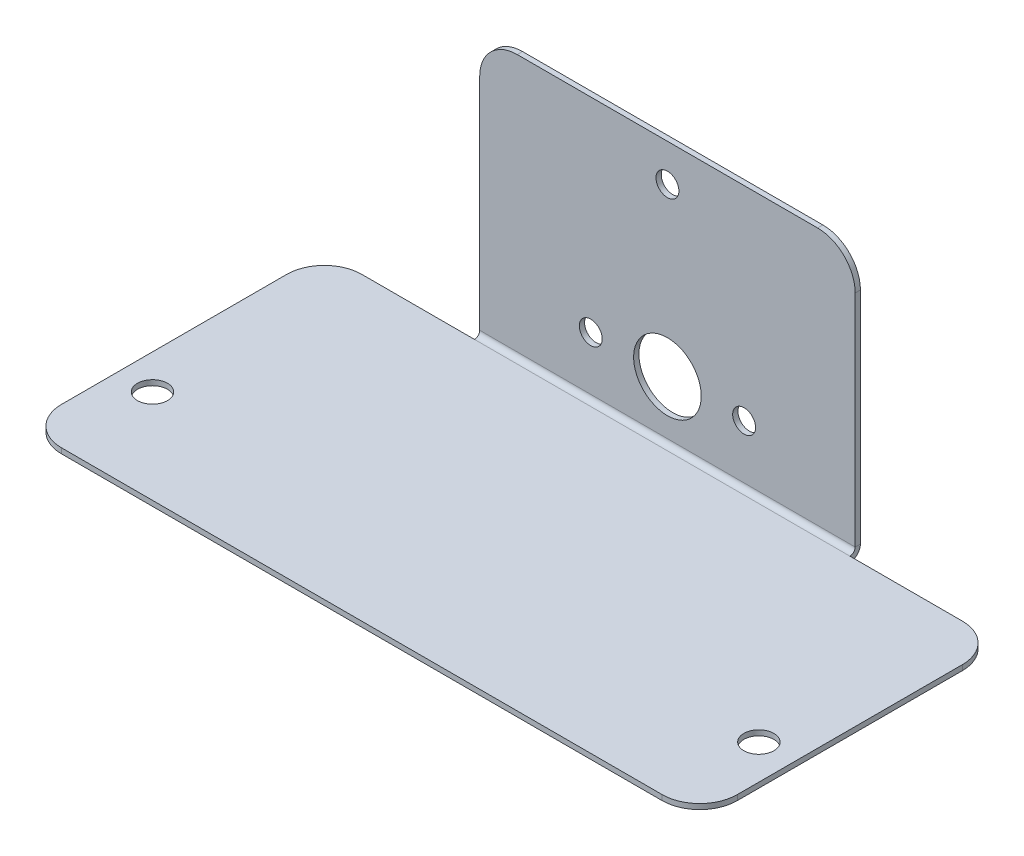
ISO-10303-21;
HEADER;
FILE_DESCRIPTION(('STEP AP214'),'2;1');
FILE_NAME('part.step','',(''),(''),'','','');
FILE_SCHEMA(('AUTOMOTIVE_DESIGN { 1 0 10303 214 1 1 1 1 }'));
ENDSEC;
DATA;
#1=APPLICATION_CONTEXT('core data for automotive mechanical design processes');
#2=APPLICATION_PROTOCOL_DEFINITION('international standard','automotive_design',2000,#1);
#3=PRODUCT_CONTEXT('',#1,'mechanical');
#4=PRODUCT('Part','Part','',(#3));
#5=PRODUCT_RELATED_PRODUCT_CATEGORY('part','',(#4));
#6=PRODUCT_DEFINITION_FORMATION('','',#4);
#7=PRODUCT_DEFINITION_CONTEXT('part definition',#1,'design');
#8=PRODUCT_DEFINITION('design','',#6,#7);
#9=PRODUCT_DEFINITION_SHAPE('','',#8);
#10=(LENGTH_UNIT() NAMED_UNIT(*) SI_UNIT(.MILLI.,.METRE.));
#11=(NAMED_UNIT(*) PLANE_ANGLE_UNIT() SI_UNIT($,.RADIAN.));
#12=(NAMED_UNIT(*) SI_UNIT($,.STERADIAN.) SOLID_ANGLE_UNIT());
#13=UNCERTAINTY_MEASURE_WITH_UNIT(LENGTH_MEASURE(1.E-05),#10,'distance_accuracy_value','');
#14=(GEOMETRIC_REPRESENTATION_CONTEXT(3) GLOBAL_UNCERTAINTY_ASSIGNED_CONTEXT((#13)) GLOBAL_UNIT_ASSIGNED_CONTEXT((#10,
#11,#12)) REPRESENTATION_CONTEXT('',''));
#15=CARTESIAN_POINT('',(0.,0.,0.));
#16=DIRECTION('',(0.,0.,1.));
#17=DIRECTION('',(1.,0.,0.));
#18=AXIS2_PLACEMENT_3D('',#15,#16,#17);
#19=CARTESIAN_POINT('',(-45.,-0.7,-20.));
#20=DIRECTION('',(0.,0.,-1.));
#21=DIRECTION('',(-1.,0.,0.));
#22=AXIS2_PLACEMENT_3D('',#19,#20,#21);
#23=PLANE('',#22);
#24=DIRECTION('',(-1.,0.,0.));
#25=VECTOR('',#24,1.);
#26=CARTESIAN_POINT('',(-45.,-0.7,-20.));
#27=LINE('',#26,#25);
#28=CARTESIAN_POINT('',(-25.,-0.7,-20.));
#29=VERTEX_POINT('',#28);
#30=CARTESIAN_POINT('',(-40.,-0.7,-20.));
#31=VERTEX_POINT('',#30);
#32=EDGE_CURVE('E290',#29,#31,#27,.T.);
#33=ORIENTED_EDGE('',*,*,#32,.T.);
#34=DIRECTION('',(0.,1.,0.));
#35=VECTOR('',#34,1.);
#36=CARTESIAN_POINT('',(-40.,-0.7,-20.));
#37=LINE('',#36,#35);
#38=CARTESIAN_POINT('',(-40.,0.,-20.));
#39=VERTEX_POINT('',#38);
#40=EDGE_CURVE('E67',#31,#39,#37,.T.);
#41=ORIENTED_EDGE('',*,*,#40,.T.);
#42=DIRECTION('',(-1.,0.,0.));
#43=VECTOR('',#42,1.);
#44=CARTESIAN_POINT('',(-45.,0.,-20.));
#45=LINE('',#44,#43);
#46=CARTESIAN_POINT('',(-25.,0.,-20.));
#47=VERTEX_POINT('',#46);
#48=EDGE_CURVE('E278',#47,#39,#45,.T.);
#49=ORIENTED_EDGE('',*,*,#48,.F.);
#50=DIRECTION('',(0.,-1.,0.));
#51=VECTOR('',#50,1.);
#52=CARTESIAN_POINT('',(-25.,0.,-20.));
#53=LINE('',#52,#51);
#54=EDGE_CURVE('E238',#47,#29,#53,.T.);
#55=ORIENTED_EDGE('',*,*,#54,.T.);
#56=EDGE_LOOP('',(#33,#41,#49,#55));
#57=FACE_BOUND('',#56,.T.);
#58=ADVANCED_FACE('F59',(#57),#23,.T.);
#59=CARTESIAN_POINT('',(45.,-0.7,-20.));
#60=DIRECTION('',(1.,0.,0.));
#61=DIRECTION('',(0.,0.,-1.));
#62=AXIS2_PLACEMENT_3D('',#59,#60,#61);
#63=PLANE('',#62);
#64=DIRECTION('',(0.,0.,-1.));
#65=VECTOR('',#64,1.);
#66=CARTESIAN_POINT('',(45.,0.,-20.));
#67=LINE('',#66,#65);
#68=CARTESIAN_POINT('',(45.,0.,15.));
#69=VERTEX_POINT('',#68);
#70=CARTESIAN_POINT('',(45.,0.,-15.));
#71=VERTEX_POINT('',#70);
#72=EDGE_CURVE('E237',#69,#71,#67,.T.);
#73=ORIENTED_EDGE('',*,*,#72,.F.);
#74=DIRECTION('',(0.,1.,0.));
#75=VECTOR('',#74,1.);
#76=CARTESIAN_POINT('',(45.,-0.7,15.));
#77=LINE('',#76,#75);
#78=CARTESIAN_POINT('',(45.,-0.7,15.));
#79=VERTEX_POINT('',#78);
#80=EDGE_CURVE('E302',#69,#79,#77,.F.);
#81=ORIENTED_EDGE('',*,*,#80,.T.);
#82=DIRECTION('',(0.,0.,-1.));
#83=VECTOR('',#82,1.);
#84=CARTESIAN_POINT('',(45.,-0.7,-20.));
#85=LINE('',#84,#83);
#86=CARTESIAN_POINT('',(45.,-0.7,-15.));
#87=VERTEX_POINT('',#86);
#88=EDGE_CURVE('E293',#79,#87,#85,.T.);
#89=ORIENTED_EDGE('',*,*,#88,.T.);
#90=DIRECTION('',(0.,1.,0.));
#91=VECTOR('',#90,1.);
#92=CARTESIAN_POINT('',(45.,-0.7,-15.));
#93=LINE('',#92,#91);
#94=EDGE_CURVE('E346',#87,#71,#93,.T.);
#95=ORIENTED_EDGE('',*,*,#94,.T.);
#96=EDGE_LOOP('',(#73,#81,#89,#95));
#97=FACE_BOUND('',#96,.T.);
#98=ADVANCED_FACE('F387',(#97),#63,.T.);
#99=CARTESIAN_POINT('',(-45.,-0.7,20.));
#100=DIRECTION('',(0.,0.,1.));
#101=DIRECTION('',(1.,0.,0.));
#102=AXIS2_PLACEMENT_3D('',#99,#100,#101);
#103=PLANE('',#102);
#104=DIRECTION('',(1.,0.,0.));
#105=VECTOR('',#104,1.);
#106=CARTESIAN_POINT('',(-45.,-0.7,20.));
#107=LINE('',#106,#105);
#108=CARTESIAN_POINT('',(-40.,-0.7,20.));
#109=VERTEX_POINT('',#108);
#110=CARTESIAN_POINT('',(40.,-0.7,20.));
#111=VERTEX_POINT('',#110);
#112=EDGE_CURVE('E254',#109,#111,#107,.T.);
#113=ORIENTED_EDGE('',*,*,#112,.T.);
#114=DIRECTION('',(0.,1.,0.));
#115=VECTOR('',#114,1.);
#116=CARTESIAN_POINT('',(40.,-0.7,20.));
#117=LINE('',#116,#115);
#118=CARTESIAN_POINT('',(40.,0.,20.));
#119=VERTEX_POINT('',#118);
#120=EDGE_CURVE('E270',#111,#119,#117,.T.);
#121=ORIENTED_EDGE('',*,*,#120,.T.);
#122=DIRECTION('',(1.,0.,0.));
#123=VECTOR('',#122,1.);
#124=CARTESIAN_POINT('',(-45.,0.,20.));
#125=LINE('',#124,#123);
#126=CARTESIAN_POINT('',(-40.,0.,20.));
#127=VERTEX_POINT('',#126);
#128=EDGE_CURVE('E289',#127,#119,#125,.T.);
#129=ORIENTED_EDGE('',*,*,#128,.F.);
#130=DIRECTION('',(0.,1.,0.));
#131=VECTOR('',#130,1.);
#132=CARTESIAN_POINT('',(-40.,-0.7,20.));
#133=LINE('',#132,#131);
#134=EDGE_CURVE('E268',#127,#109,#133,.F.);
#135=ORIENTED_EDGE('',*,*,#134,.T.);
#136=EDGE_LOOP('',(#113,#121,#129,#135));
#137=FACE_BOUND('',#136,.T.);
#138=ADVANCED_FACE('F392',(#137),#103,.T.);
#139=CARTESIAN_POINT('',(-45.,-0.7,-20.));
#140=DIRECTION('',(-1.,0.,0.));
#141=DIRECTION('',(0.,0.,1.));
#142=AXIS2_PLACEMENT_3D('',#139,#140,#141);
#143=PLANE('',#142);
#144=DIRECTION('',(0.,0.,1.));
#145=VECTOR('',#144,1.);
#146=CARTESIAN_POINT('',(-45.,-0.7,-20.));
#147=LINE('',#146,#145);
#148=CARTESIAN_POINT('',(-45.,-0.7,-15.));
#149=VERTEX_POINT('',#148);
#150=CARTESIAN_POINT('',(-45.,-0.7,15.));
#151=VERTEX_POINT('',#150);
#152=EDGE_CURVE('E297',#149,#151,#147,.T.);
#153=ORIENTED_EDGE('',*,*,#152,.T.);
#154=DIRECTION('',(0.,1.,0.));
#155=VECTOR('',#154,1.);
#156=CARTESIAN_POINT('',(-45.,-0.7,15.));
#157=LINE('',#156,#155);
#158=CARTESIAN_POINT('',(-45.,0.,15.));
#159=VERTEX_POINT('',#158);
#160=EDGE_CURVE('E313',#151,#159,#157,.T.);
#161=ORIENTED_EDGE('',*,*,#160,.T.);
#162=DIRECTION('',(0.,0.,1.));
#163=VECTOR('',#162,1.);
#164=CARTESIAN_POINT('',(-45.,0.,-20.));
#165=LINE('',#164,#163);
#166=CARTESIAN_POINT('',(-45.,0.,-15.));
#167=VERTEX_POINT('',#166);
#168=EDGE_CURVE('E277',#167,#159,#165,.T.);
#169=ORIENTED_EDGE('',*,*,#168,.F.);
#170=DIRECTION('',(0.,1.,0.));
#171=VECTOR('',#170,1.);
#172=CARTESIAN_POINT('',(-45.,-0.7,-15.));
#173=LINE('',#172,#171);
#174=EDGE_CURVE('E311',#167,#149,#173,.F.);
#175=ORIENTED_EDGE('',*,*,#174,.T.);
#176=EDGE_LOOP('',(#153,#161,#169,#175));
#177=FACE_BOUND('',#176,.T.);
#178=ADVANCED_FACE('F396',(#177),#143,.T.);
#179=CARTESIAN_POINT('',(40.,0.,-20.));
#180=VERTEX_POINT('',#179);
#181=CARTESIAN_POINT('',(25.,0.,-20.));
#182=VERTEX_POINT('',#181);
#183=EDGE_CURVE('E274',#180,#182,#45,.T.);
#184=ORIENTED_EDGE('',*,*,#183,.F.);
#185=DIRECTION('',(0.,1.,0.));
#186=VECTOR('',#185,1.);
#187=CARTESIAN_POINT('',(40.,-0.7,-20.));
#188=LINE('',#187,#186);
#189=CARTESIAN_POINT('',(40.,-0.7,-20.));
#190=VERTEX_POINT('',#189);
#191=EDGE_CURVE('E13',#180,#190,#188,.F.);
#192=ORIENTED_EDGE('',*,*,#191,.T.);
#193=CARTESIAN_POINT('',(25.,-0.700000000000012,-20.));
#194=VERTEX_POINT('',#193);
#195=EDGE_CURVE('E292',#190,#194,#27,.T.);
#196=ORIENTED_EDGE('',*,*,#195,.T.);
#197=DIRECTION('',(0.,-1.,0.));
#198=VECTOR('',#197,1.);
#199=CARTESIAN_POINT('',(25.,0.,-20.));
#200=LINE('',#199,#198);
#201=EDGE_CURVE('E233',#182,#194,#200,.T.);
#202=ORIENTED_EDGE('',*,*,#201,.F.);
#203=EDGE_LOOP('',(#184,#192,#196,#202));
#204=FACE_BOUND('',#203,.T.);
#205=ADVANCED_FACE('F354',(#204),#23,.T.);
#206=CARTESIAN_POINT('',(0.,-0.7,0.));
#207=DIRECTION('',(0.,1.,0.));
#208=DIRECTION('',(0.,0.,1.));
#209=AXIS2_PLACEMENT_3D('',#206,#207,#208);
#210=PLANE('',#209);
#211=CARTESIAN_POINT('',(40.378,-0.7,7.5));
#212=DIRECTION('',(0.,1.,0.));
#213=DIRECTION('',(0.,0.,1.));
#214=AXIS2_PLACEMENT_3D('',#211,#212,#213);
#215=CIRCLE('',#214,2.);
#216=CARTESIAN_POINT('',(40.378,-0.7,9.5));
#217=VERTEX_POINT('',#216);
#218=EDGE_CURVE('E721',#217,#217,#215,.F.);
#219=ORIENTED_EDGE('',*,*,#218,.F.);
#220=EDGE_LOOP('',(#219));
#221=FACE_BOUND('',#220,.T.);
#222=CARTESIAN_POINT('',(-40.378,-0.7,7.5));
#223=DIRECTION('',(0.,1.,0.));
#224=DIRECTION('',(0.,0.,1.));
#225=AXIS2_PLACEMENT_3D('',#222,#223,#224);
#226=CIRCLE('',#225,2.);
#227=CARTESIAN_POINT('',(-40.378,-0.7,9.5));
#228=VERTEX_POINT('',#227);
#229=EDGE_CURVE('E715',#228,#228,#226,.F.);
#230=ORIENTED_EDGE('',*,*,#229,.F.);
#231=EDGE_LOOP('',(#230));
#232=FACE_BOUND('',#231,.T.);
#233=ORIENTED_EDGE('',*,*,#88,.F.);
#234=CARTESIAN_POINT('',(40.,-0.7,15.));
#235=DIRECTION('',(0.,1.,0.));
#236=DIRECTION('',(0.,0.,1.));
#237=AXIS2_PLACEMENT_3D('',#234,#235,#236);
#238=CIRCLE('',#237,5.);
#239=EDGE_CURVE('E309',#79,#111,#238,.F.);
#240=ORIENTED_EDGE('',*,*,#239,.T.);
#241=ORIENTED_EDGE('',*,*,#112,.F.);
#242=CARTESIAN_POINT('',(-40.,-0.7,15.));
#243=DIRECTION('',(0.,1.,0.));
#244=DIRECTION('',(0.,0.,1.));
#245=AXIS2_PLACEMENT_3D('',#242,#243,#244);
#246=CIRCLE('',#245,5.);
#247=EDGE_CURVE('E307',#109,#151,#246,.F.);
#248=ORIENTED_EDGE('',*,*,#247,.T.);
#249=ORIENTED_EDGE('',*,*,#152,.F.);
#250=CARTESIAN_POINT('',(-40.,-0.7,-15.));
#251=DIRECTION('',(0.,1.,0.));
#252=DIRECTION('',(0.,0.,1.));
#253=AXIS2_PLACEMENT_3D('',#250,#251,#252);
#254=CIRCLE('',#253,5.);
#255=EDGE_CURVE('E80',#149,#31,#254,.F.);
#256=ORIENTED_EDGE('',*,*,#255,.T.);
#257=ORIENTED_EDGE('',*,*,#32,.F.);
#258=DIRECTION('',(-1.,0.,0.));
#259=VECTOR('',#258,1.);
#260=CARTESIAN_POINT('',(-25.,-0.700000000000012,-20.));
#261=LINE('',#260,#259);
#262=EDGE_CURVE('E181',#29,#194,#261,.F.);
#263=ORIENTED_EDGE('',*,*,#262,.T.);
#264=ORIENTED_EDGE('',*,*,#195,.F.);
#265=CARTESIAN_POINT('',(40.,-0.7,-15.));
#266=DIRECTION('',(0.,1.,0.));
#267=DIRECTION('',(0.,0.,1.));
#268=AXIS2_PLACEMENT_3D('',#265,#266,#267);
#269=CIRCLE('',#268,5.);
#270=EDGE_CURVE('E304',#190,#87,#269,.F.);
#271=ORIENTED_EDGE('',*,*,#270,.T.);
#272=EDGE_LOOP('',(#233,#240,#241,#248,#249,#256,#257,#263,#264,#271));
#273=FACE_BOUND('',#272,.T.);
#274=ADVANCED_FACE('F339',(#221,#232,#273),#210,.F.);
#275=CARTESIAN_POINT('',(0.,0.,0.));
#276=DIRECTION('',(0.,1.,0.));
#277=DIRECTION('',(0.,0.,1.));
#278=AXIS2_PLACEMENT_3D('',#275,#276,#277);
#279=PLANE('',#278);
#280=CARTESIAN_POINT('',(40.378,0.,7.5));
#281=DIRECTION('',(0.,1.,0.));
#282=DIRECTION('',(0.,0.,-1.));
#283=AXIS2_PLACEMENT_3D('',#280,#281,#282);
#284=CIRCLE('',#283,2.);
#285=CARTESIAN_POINT('',(40.378,0.,5.49999999999999));
#286=VERTEX_POINT('',#285);
#287=EDGE_CURVE('E724',#286,#286,#284,.T.);
#288=ORIENTED_EDGE('',*,*,#287,.F.);
#289=EDGE_LOOP('',(#288));
#290=FACE_BOUND('',#289,.T.);
#291=CARTESIAN_POINT('',(-40.378,0.,7.5));
#292=DIRECTION('',(0.,1.,0.));
#293=DIRECTION('',(0.,0.,1.));
#294=AXIS2_PLACEMENT_3D('',#291,#292,#293);
#295=CIRCLE('',#294,2.);
#296=CARTESIAN_POINT('',(-40.378,0.,9.5));
#297=VERTEX_POINT('',#296);
#298=EDGE_CURVE('E718',#297,#297,#295,.T.);
#299=ORIENTED_EDGE('',*,*,#298,.F.);
#300=EDGE_LOOP('',(#299));
#301=FACE_BOUND('',#300,.T.);
#302=ORIENTED_EDGE('',*,*,#128,.T.);
#303=CARTESIAN_POINT('',(40.,0.,15.));
#304=DIRECTION('',(0.,1.,0.));
#305=DIRECTION('',(0.,0.,1.));
#306=AXIS2_PLACEMENT_3D('',#303,#304,#305);
#307=CIRCLE('',#306,5.);
#308=EDGE_CURVE('E350',#119,#69,#307,.T.);
#309=ORIENTED_EDGE('',*,*,#308,.T.);
#310=ORIENTED_EDGE('',*,*,#72,.T.);
#311=CARTESIAN_POINT('',(40.,0.,-15.));
#312=DIRECTION('',(0.,1.,0.));
#313=DIRECTION('',(0.,0.,1.));
#314=AXIS2_PLACEMENT_3D('',#311,#312,#313);
#315=CIRCLE('',#314,5.);
#316=EDGE_CURVE('E273',#71,#180,#315,.T.);
#317=ORIENTED_EDGE('',*,*,#316,.T.);
#318=ORIENTED_EDGE('',*,*,#183,.T.);
#319=DIRECTION('',(-1.,0.,0.));
#320=VECTOR('',#319,1.);
#321=CARTESIAN_POINT('',(-25.,0.,-20.));
#322=LINE('',#321,#320);
#323=EDGE_CURVE('E243',#47,#182,#322,.F.);
#324=ORIENTED_EDGE('',*,*,#323,.F.);
#325=ORIENTED_EDGE('',*,*,#48,.T.);
#326=CARTESIAN_POINT('',(-40.,0.,-15.));
#327=DIRECTION('',(0.,1.,0.));
#328=DIRECTION('',(0.,0.,1.));
#329=AXIS2_PLACEMENT_3D('',#326,#327,#328);
#330=CIRCLE('',#329,5.);
#331=EDGE_CURVE('E325',#39,#167,#330,.T.);
#332=ORIENTED_EDGE('',*,*,#331,.T.);
#333=ORIENTED_EDGE('',*,*,#168,.T.);
#334=CARTESIAN_POINT('',(-40.,0.,15.));
#335=DIRECTION('',(0.,1.,0.));
#336=DIRECTION('',(0.,0.,1.));
#337=AXIS2_PLACEMENT_3D('',#334,#335,#336);
#338=CIRCLE('',#337,5.);
#339=EDGE_CURVE('E351',#159,#127,#338,.T.);
#340=ORIENTED_EDGE('',*,*,#339,.T.);
#341=EDGE_LOOP('',(#302,#309,#310,#317,#318,#324,#325,#332,#333,#340));
#342=FACE_BOUND('',#341,.T.);
#343=ADVANCED_FACE('F323',(#290,#301,#342),#279,.T.);
#344=CARTESIAN_POINT('',(25.,0.699999999999991,-20.));
#345=DIRECTION('',(1.,0.,0.));
#346=DIRECTION('',(0.,0.,-1.));
#347=AXIS2_PLACEMENT_3D('',#344,#345,#346);
#348=PLANE('',#347);
#349=DIRECTION('',(0.,0.,1.));
#350=VECTOR('',#349,1.);
#351=CARTESIAN_POINT('',(25.,0.700000000000001,-21.4));
#352=LINE('',#351,#350);
#353=CARTESIAN_POINT('',(25.,0.699999999999989,-20.7));
#354=VERTEX_POINT('',#353);
#355=CARTESIAN_POINT('',(25.,0.699999999999986,-21.4));
#356=VERTEX_POINT('',#355);
#357=EDGE_CURVE('E224',#354,#356,#352,.F.);
#358=ORIENTED_EDGE('',*,*,#357,.F.);
#359=CARTESIAN_POINT('',(25.,0.699999999999991,-20.));
#360=DIRECTION('',(-1.,0.,0.));
#361=DIRECTION('',(0.,0.,1.));
#362=AXIS2_PLACEMENT_3D('',#359,#360,#361);
#363=CIRCLE('',#362,0.700000000000003);
#364=EDGE_CURVE('E184',#182,#354,#363,.F.);
#365=ORIENTED_EDGE('',*,*,#364,.F.);
#366=ORIENTED_EDGE('',*,*,#201,.T.);
#367=CARTESIAN_POINT('',(25.,0.699999999999991,-20.));
#368=DIRECTION('',(-1.,0.,0.));
#369=DIRECTION('',(0.,0.,1.));
#370=AXIS2_PLACEMENT_3D('',#367,#368,#369);
#371=CIRCLE('',#370,1.4);
#372=EDGE_CURVE('E246',#194,#356,#371,.F.);
#373=ORIENTED_EDGE('',*,*,#372,.T.);
#374=EDGE_LOOP('',(#358,#365,#366,#373));
#375=FACE_BOUND('',#374,.T.);
#376=ADVANCED_FACE('F357',(#375),#348,.T.);
#377=CARTESIAN_POINT('',(-25.,0.699999999999991,-20.));
#378=DIRECTION('',(1.,0.,0.));
#379=DIRECTION('',(0.,0.,-1.));
#380=AXIS2_PLACEMENT_3D('',#377,#378,#379);
#381=PLANE('',#380);
#382=CARTESIAN_POINT('',(-25.,0.699999999999991,-20.));
#383=DIRECTION('',(-1.,0.,0.));
#384=DIRECTION('',(0.,0.,1.));
#385=AXIS2_PLACEMENT_3D('',#382,#383,#384);
#386=CIRCLE('',#385,0.700000000000003);
#387=CARTESIAN_POINT('',(-25.,0.699999999999989,-20.7));
#388=VERTEX_POINT('',#387);
#389=EDGE_CURVE('E191',#388,#47,#386,.T.);
#390=ORIENTED_EDGE('',*,*,#389,.F.);
#391=DIRECTION('',(0.,0.,1.));
#392=VECTOR('',#391,1.);
#393=CARTESIAN_POINT('',(-25.,0.699999999999996,-20.7));
#394=LINE('',#393,#392);
#395=CARTESIAN_POINT('',(-25.,0.700000000000001,-21.4));
#396=VERTEX_POINT('',#395);
#397=EDGE_CURVE('E188',#388,#396,#394,.F.);
#398=ORIENTED_EDGE('',*,*,#397,.T.);
#399=CARTESIAN_POINT('',(-25.,0.699999999999991,-20.));
#400=DIRECTION('',(-1.,0.,0.));
#401=DIRECTION('',(0.,0.,1.));
#402=AXIS2_PLACEMENT_3D('',#399,#400,#401);
#403=CIRCLE('',#402,1.4);
#404=EDGE_CURVE('E173',#396,#29,#403,.T.);
#405=ORIENTED_EDGE('',*,*,#404,.T.);
#406=ORIENTED_EDGE('',*,*,#54,.F.);
#407=EDGE_LOOP('',(#390,#398,#405,#406));
#408=FACE_BOUND('',#407,.T.);
#409=ADVANCED_FACE('F189',(#408),#381,.F.);
#410=CARTESIAN_POINT('',(-25.,0.699999999999991,-20.));
#411=DIRECTION('',(-1.,0.,0.));
#412=DIRECTION('',(0.,0.,-1.));
#413=AXIS2_PLACEMENT_3D('',#410,#411,#412);
#414=CYLINDRICAL_SURFACE('',#413,1.4);
#415=ORIENTED_EDGE('',*,*,#262,.F.);
#416=ORIENTED_EDGE('',*,*,#404,.F.);
#417=DIRECTION('',(-1.,0.,0.));
#418=VECTOR('',#417,1.);
#419=CARTESIAN_POINT('',(25.,0.700000000000001,-21.4));
#420=LINE('',#419,#418);
#421=EDGE_CURVE('E178',#396,#356,#420,.F.);
#422=ORIENTED_EDGE('',*,*,#421,.T.);
#423=ORIENTED_EDGE('',*,*,#372,.F.);
#424=EDGE_LOOP('',(#415,#416,#422,#423));
#425=FACE_BOUND('',#424,.T.);
#426=ADVANCED_FACE('F175',(#425),#414,.T.);
#427=CARTESIAN_POINT('',(-25.,0.699999999999991,-20.));
#428=DIRECTION('',(-1.,0.,0.));
#429=DIRECTION('',(0.,0.,-1.));
#430=AXIS2_PLACEMENT_3D('',#427,#428,#429);
#431=CYLINDRICAL_SURFACE('',#430,0.700000000000003);
#432=ORIENTED_EDGE('',*,*,#323,.T.);
#433=ORIENTED_EDGE('',*,*,#364,.T.);
#434=DIRECTION('',(-1.,0.,0.));
#435=VECTOR('',#434,1.);
#436=CARTESIAN_POINT('',(25.,0.699999999999996,-20.7));
#437=LINE('',#436,#435);
#438=EDGE_CURVE('E196',#354,#388,#437,.T.);
#439=ORIENTED_EDGE('',*,*,#438,.T.);
#440=ORIENTED_EDGE('',*,*,#389,.T.);
#441=EDGE_LOOP('',(#432,#433,#439,#440));
#442=FACE_BOUND('',#441,.T.);
#443=ADVANCED_FACE('F359',(#442),#431,.F.);
#444=CARTESIAN_POINT('',(25.,0.,-21.4));
#445=DIRECTION('',(-1.,0.,0.));
#446=DIRECTION('',(0.,-1.,0.));
#447=AXIS2_PLACEMENT_3D('',#444,#445,#446);
#448=PLANE('',#447);
#449=DIRECTION('',(0.,-1.,0.));
#450=VECTOR('',#449,1.);
#451=CARTESIAN_POINT('',(25.,0.,-21.4));
#452=LINE('',#451,#450);
#453=CARTESIAN_POINT('',(25.,30.,-21.4000000000001));
#454=VERTEX_POINT('',#453);
#455=EDGE_CURVE('E205',#454,#356,#452,.T.);
#456=ORIENTED_EDGE('',*,*,#455,.F.);
#457=DIRECTION('',(0.,0.,1.));
#458=VECTOR('',#457,1.);
#459=CARTESIAN_POINT('',(25.,30.,-21.4000000000001));
#460=LINE('',#459,#458);
#461=CARTESIAN_POINT('',(25.,30.,-20.7000000000001));
#462=VERTEX_POINT('',#461);
#463=EDGE_CURVE('E250',#454,#462,#460,.T.);
#464=ORIENTED_EDGE('',*,*,#463,.T.);
#465=DIRECTION('',(0.,1.,0.));
#466=VECTOR('',#465,1.);
#467=CARTESIAN_POINT('',(25.,0.,-20.7));
#468=LINE('',#467,#466);
#469=EDGE_CURVE('E206',#462,#354,#468,.F.);
#470=ORIENTED_EDGE('',*,*,#469,.T.);
#471=ORIENTED_EDGE('',*,*,#357,.T.);
#472=EDGE_LOOP('',(#456,#464,#470,#471));
#473=FACE_BOUND('',#472,.T.);
#474=ADVANCED_FACE('F376',(#473),#448,.F.);
#475=CARTESIAN_POINT('',(-25.,35.,-21.4000000000001));
#476=DIRECTION('',(1.,0.,0.));
#477=DIRECTION('',(0.,1.,0.));
#478=AXIS2_PLACEMENT_3D('',#475,#476,#477);
#479=PLANE('',#478);
#480=DIRECTION('',(0.,-1.,0.));
#481=VECTOR('',#480,1.);
#482=CARTESIAN_POINT('',(-25.,35.,-20.7000000000001));
#483=LINE('',#482,#481);
#484=CARTESIAN_POINT('',(-25.,30.,-20.7000000000001));
#485=VERTEX_POINT('',#484);
#486=EDGE_CURVE('E220',#388,#485,#483,.F.);
#487=ORIENTED_EDGE('',*,*,#486,.T.);
#488=DIRECTION('',(0.,0.,1.));
#489=VECTOR('',#488,1.);
#490=CARTESIAN_POINT('',(-25.,30.,-21.4000000000001));
#491=LINE('',#490,#489);
#492=CARTESIAN_POINT('',(-25.,30.,-21.4000000000001));
#493=VERTEX_POINT('',#492);
#494=EDGE_CURVE('E210',#485,#493,#491,.F.);
#495=ORIENTED_EDGE('',*,*,#494,.T.);
#496=DIRECTION('',(0.,1.,0.));
#497=VECTOR('',#496,1.);
#498=CARTESIAN_POINT('',(-25.,0.,-21.4));
#499=LINE('',#498,#497);
#500=EDGE_CURVE('E202',#396,#493,#499,.T.);
#501=ORIENTED_EDGE('',*,*,#500,.F.);
#502=ORIENTED_EDGE('',*,*,#397,.F.);
#503=EDGE_LOOP('',(#487,#495,#501,#502));
#504=FACE_BOUND('',#503,.T.);
#505=ADVANCED_FACE('F208',(#504),#479,.F.);
#506=CARTESIAN_POINT('',(0.,0.,-21.4));
#507=DIRECTION('',(0.,0.,1.));
#508=DIRECTION('',(0.,-1.,0.));
#509=AXIS2_PLACEMENT_3D('',#506,#507,#508);
#510=PLANE('',#509);
#511=CARTESIAN_POINT('',(0.,7.85062999999999,-21.4));
#512=DIRECTION('',(0.,0.,1.));
#513=DIRECTION('',(0.,-1.,0.));
#514=AXIS2_PLACEMENT_3D('',#511,#512,#513);
#515=CIRCLE('',#514,4.5);
#516=CARTESIAN_POINT('',(0.,3.35062999999999,-21.4));
#517=VERTEX_POINT('',#516);
#518=EDGE_CURVE('E711',#517,#517,#515,.F.);
#519=ORIENTED_EDGE('',*,*,#518,.F.);
#520=EDGE_LOOP('',(#519));
#521=FACE_BOUND('',#520,.T.);
#522=CARTESIAN_POINT('',(-10.2108,7.85063000000002,-21.4));
#523=DIRECTION('',(0.,0.,1.));
#524=DIRECTION('',(0.,-1.,0.));
#525=AXIS2_PLACEMENT_3D('',#522,#523,#524);
#526=CIRCLE('',#525,1.525);
#527=CARTESIAN_POINT('',(-10.2108,6.32563000000002,-21.4));
#528=VERTEX_POINT('',#527);
#529=EDGE_CURVE('E707',#528,#528,#526,.F.);
#530=ORIENTED_EDGE('',*,*,#529,.F.);
#531=EDGE_LOOP('',(#530));
#532=FACE_BOUND('',#531,.T.);
#533=CARTESIAN_POINT('',(10.2108,7.85063000000008,-21.4));
#534=DIRECTION('',(0.,0.,1.));
#535=DIRECTION('',(0.,-1.,0.));
#536=AXIS2_PLACEMENT_3D('',#533,#534,#535);
#537=CIRCLE('',#536,1.525);
#538=CARTESIAN_POINT('',(10.2108,6.32563000000008,-21.4));
#539=VERTEX_POINT('',#538);
#540=EDGE_CURVE('E700',#539,#539,#537,.F.);
#541=ORIENTED_EDGE('',*,*,#540,.F.);
#542=EDGE_LOOP('',(#541));
#543=FACE_BOUND('',#542,.T.);
#544=CARTESIAN_POINT('',(-1.12464749538698E-13,30.02483,-21.4000000000001));
#545=DIRECTION('',(0.,0.,1.));
#546=DIRECTION('',(0.,-1.,0.));
#547=AXIS2_PLACEMENT_3D('',#544,#545,#546);
#548=CIRCLE('',#547,1.525);
#549=CARTESIAN_POINT('',(-1.12464749538698E-13,28.49983,-21.4000000000001));
#550=VERTEX_POINT('',#549);
#551=EDGE_CURVE('E227',#550,#550,#548,.F.);
#552=ORIENTED_EDGE('',*,*,#551,.F.);
#553=EDGE_LOOP('',(#552));
#554=FACE_BOUND('',#553,.T.);
#555=DIRECTION('',(1.,0.,0.));
#556=VECTOR('',#555,1.);
#557=CARTESIAN_POINT('',(0.,35.,-21.4000000000001));
#558=LINE('',#557,#556);
#559=CARTESIAN_POINT('',(-20.,35.,-21.4000000000001));
#560=VERTEX_POINT('',#559);
#561=CARTESIAN_POINT('',(20.,35.,-21.4000000000001));
#562=VERTEX_POINT('',#561);
#563=EDGE_CURVE('E211',#560,#562,#558,.T.);
#564=ORIENTED_EDGE('',*,*,#563,.T.);
#565=CARTESIAN_POINT('',(20.,30.,-21.4000000000001));
#566=DIRECTION('',(0.,0.,1.));
#567=DIRECTION('',(0.,-1.,0.));
#568=AXIS2_PLACEMENT_3D('',#565,#566,#567);
#569=CIRCLE('',#568,5.);
#570=EDGE_CURVE('E265',#562,#454,#569,.F.);
#571=ORIENTED_EDGE('',*,*,#570,.T.);
#572=ORIENTED_EDGE('',*,*,#455,.T.);
#573=ORIENTED_EDGE('',*,*,#421,.F.);
#574=ORIENTED_EDGE('',*,*,#500,.T.);
#575=CARTESIAN_POINT('',(-20.,30.,-21.4000000000001));
#576=DIRECTION('',(0.,0.,1.));
#577=DIRECTION('',(0.,-1.,0.));
#578=AXIS2_PLACEMENT_3D('',#575,#576,#577);
#579=CIRCLE('',#578,5.);
#580=EDGE_CURVE('E263',#493,#560,#579,.F.);
#581=ORIENTED_EDGE('',*,*,#580,.T.);
#582=EDGE_LOOP('',(#564,#571,#572,#573,#574,#581));
#583=FACE_BOUND('',#582,.T.);
#584=ADVANCED_FACE('F201',(#521,#532,#543,#554,#583),#510,.F.);
#585=CARTESIAN_POINT('',(0.,0.,-20.7));
#586=DIRECTION('',(0.,0.,1.));
#587=DIRECTION('',(0.,-1.,0.));
#588=AXIS2_PLACEMENT_3D('',#585,#586,#587);
#589=PLANE('',#588);
#590=CARTESIAN_POINT('',(0.,7.85062999999999,-20.7));
#591=DIRECTION('',(0.,0.,1.));
#592=DIRECTION('',(1.,0.,0.));
#593=AXIS2_PLACEMENT_3D('',#590,#591,#592);
#594=CIRCLE('',#593,4.5);
#595=CARTESIAN_POINT('',(4.49999999999996,7.85062999999999,-20.7));
#596=VERTEX_POINT('',#595);
#597=EDGE_CURVE('E688',#596,#596,#594,.T.);
#598=ORIENTED_EDGE('',*,*,#597,.F.);
#599=EDGE_LOOP('',(#598));
#600=FACE_BOUND('',#599,.T.);
#601=CARTESIAN_POINT('',(-10.2108,7.85063000000002,-20.7));
#602=DIRECTION('',(0.,0.,1.));
#603=DIRECTION('',(1.,0.,0.));
#604=AXIS2_PLACEMENT_3D('',#601,#602,#603);
#605=CIRCLE('',#604,1.525);
#606=CARTESIAN_POINT('',(-8.68580000000004,7.85063000000002,-20.7));
#607=VERTEX_POINT('',#606);
#608=EDGE_CURVE('E692',#607,#607,#605,.T.);
#609=ORIENTED_EDGE('',*,*,#608,.F.);
#610=EDGE_LOOP('',(#609));
#611=FACE_BOUND('',#610,.T.);
#612=CARTESIAN_POINT('',(10.2108,7.85063000000008,-20.7));
#613=DIRECTION('',(0.,0.,1.));
#614=DIRECTION('',(1.,0.,0.));
#615=AXIS2_PLACEMENT_3D('',#612,#613,#614);
#616=CIRCLE('',#615,1.525);
#617=CARTESIAN_POINT('',(11.7358,7.85063000000008,-20.7));
#618=VERTEX_POINT('',#617);
#619=EDGE_CURVE('E696',#618,#618,#616,.T.);
#620=ORIENTED_EDGE('',*,*,#619,.F.);
#621=EDGE_LOOP('',(#620));
#622=FACE_BOUND('',#621,.T.);
#623=CARTESIAN_POINT('',(-1.12464749538698E-13,30.02483,-20.7));
#624=DIRECTION('',(0.,0.,1.));
#625=DIRECTION('',(1.,0.,0.));
#626=AXIS2_PLACEMENT_3D('',#623,#624,#625);
#627=CIRCLE('',#626,1.525);
#628=CARTESIAN_POINT('',(1.52499999999989,30.02483,-20.7));
#629=VERTEX_POINT('',#628);
#630=EDGE_CURVE('E699',#629,#629,#627,.T.);
#631=ORIENTED_EDGE('',*,*,#630,.F.);
#632=EDGE_LOOP('',(#631));
#633=FACE_BOUND('',#632,.T.);
#634=ORIENTED_EDGE('',*,*,#469,.F.);
#635=CARTESIAN_POINT('',(20.,30.,-20.7000000000001));
#636=DIRECTION('',(0.,0.,1.));
#637=DIRECTION('',(0.,-1.,0.));
#638=AXIS2_PLACEMENT_3D('',#635,#636,#637);
#639=CIRCLE('',#638,5.);
#640=CARTESIAN_POINT('',(20.,35.,-20.7000000000001));
#641=VERTEX_POINT('',#640);
#642=EDGE_CURVE('E256',#462,#641,#639,.T.);
#643=ORIENTED_EDGE('',*,*,#642,.T.);
#644=DIRECTION('',(-1.,0.,0.));
#645=VECTOR('',#644,1.);
#646=CARTESIAN_POINT('',(25.,35.,-20.7000000000001));
#647=LINE('',#646,#645);
#648=CARTESIAN_POINT('',(-20.,35.,-20.7000000000001));
#649=VERTEX_POINT('',#648);
#650=EDGE_CURVE('E214',#649,#641,#647,.F.);
#651=ORIENTED_EDGE('',*,*,#650,.F.);
#652=CARTESIAN_POINT('',(-20.,30.,-20.7000000000001));
#653=DIRECTION('',(0.,0.,1.));
#654=DIRECTION('',(0.,-1.,0.));
#655=AXIS2_PLACEMENT_3D('',#652,#653,#654);
#656=CIRCLE('',#655,5.);
#657=EDGE_CURVE('E253',#649,#485,#656,.T.);
#658=ORIENTED_EDGE('',*,*,#657,.T.);
#659=ORIENTED_EDGE('',*,*,#486,.F.);
#660=ORIENTED_EDGE('',*,*,#438,.F.);
#661=EDGE_LOOP('',(#634,#643,#651,#658,#659,#660));
#662=FACE_BOUND('',#661,.T.);
#663=ADVANCED_FACE('F362',(#600,#611,#622,#633,#662),#589,.T.);
#664=CARTESIAN_POINT('',(25.,35.,-21.4000000000001));
#665=DIRECTION('',(0.,-1.,0.));
#666=DIRECTION('',(0.,0.,-1.));
#667=AXIS2_PLACEMENT_3D('',#664,#665,#666);
#668=PLANE('',#667);
#669=ORIENTED_EDGE('',*,*,#650,.T.);
#670=DIRECTION('',(0.,0.,1.));
#671=VECTOR('',#670,1.);
#672=CARTESIAN_POINT('',(20.,35.,-21.4000000000001));
#673=LINE('',#672,#671);
#674=EDGE_CURVE('E261',#641,#562,#673,.F.);
#675=ORIENTED_EDGE('',*,*,#674,.T.);
#676=ORIENTED_EDGE('',*,*,#563,.F.);
#677=DIRECTION('',(0.,0.,1.));
#678=VECTOR('',#677,1.);
#679=CARTESIAN_POINT('',(-20.,35.,-21.4000000000001));
#680=LINE('',#679,#678);
#681=EDGE_CURVE('E258',#560,#649,#680,.T.);
#682=ORIENTED_EDGE('',*,*,#681,.T.);
#683=EDGE_LOOP('',(#669,#675,#676,#682));
#684=FACE_BOUND('',#683,.T.);
#685=ADVANCED_FACE('F370',(#684),#668,.F.);
#686=CARTESIAN_POINT('',(-1.12464749538698E-13,30.02483,-21.401025));
#687=DIRECTION('',(0.,0.,1.));
#688=DIRECTION('',(1.,0.,0.));
#689=AXIS2_PLACEMENT_3D('',#686,#687,#688);
#690=CYLINDRICAL_SURFACE('',#689,1.525);
#691=ORIENTED_EDGE('',*,*,#630,.T.);
#692=EDGE_LOOP('',(#691));
#693=FACE_BOUND('',#692,.T.);
#694=ORIENTED_EDGE('',*,*,#551,.T.);
#695=EDGE_LOOP('',(#694));
#696=FACE_BOUND('',#695,.T.);
#697=ADVANCED_FACE('F433',(#693,#696),#690,.F.);
#698=CARTESIAN_POINT('',(10.2108,7.85063000000008,-21.401025));
#699=DIRECTION('',(0.,0.,1.));
#700=DIRECTION('',(1.,0.,0.));
#701=AXIS2_PLACEMENT_3D('',#698,#699,#700);
#702=CYLINDRICAL_SURFACE('',#701,1.525);
#703=ORIENTED_EDGE('',*,*,#619,.T.);
#704=EDGE_LOOP('',(#703));
#705=FACE_BOUND('',#704,.T.);
#706=ORIENTED_EDGE('',*,*,#540,.T.);
#707=EDGE_LOOP('',(#706));
#708=FACE_BOUND('',#707,.T.);
#709=ADVANCED_FACE('F438',(#705,#708),#702,.F.);
#710=CARTESIAN_POINT('',(-10.2108,7.85063000000002,-21.401025));
#711=DIRECTION('',(0.,0.,1.));
#712=DIRECTION('',(1.,0.,0.));
#713=AXIS2_PLACEMENT_3D('',#710,#711,#712);
#714=CYLINDRICAL_SURFACE('',#713,1.525);
#715=ORIENTED_EDGE('',*,*,#608,.T.);
#716=EDGE_LOOP('',(#715));
#717=FACE_BOUND('',#716,.T.);
#718=ORIENTED_EDGE('',*,*,#529,.T.);
#719=EDGE_LOOP('',(#718));
#720=FACE_BOUND('',#719,.T.);
#721=ADVANCED_FACE('F451',(#717,#720),#714,.F.);
#722=CARTESIAN_POINT('',(0.,7.85062999999999,-21.401025));
#723=DIRECTION('',(0.,0.,1.));
#724=DIRECTION('',(1.,0.,0.));
#725=AXIS2_PLACEMENT_3D('',#722,#723,#724);
#726=CYLINDRICAL_SURFACE('',#725,4.5);
#727=ORIENTED_EDGE('',*,*,#597,.T.);
#728=EDGE_LOOP('',(#727));
#729=FACE_BOUND('',#728,.T.);
#730=ORIENTED_EDGE('',*,*,#518,.T.);
#731=EDGE_LOOP('',(#730));
#732=FACE_BOUND('',#731,.T.);
#733=ADVANCED_FACE('F462',(#729,#732),#726,.F.);
#734=CARTESIAN_POINT('',(-40.378,-0.701050000000012,7.5));
#735=DIRECTION('',(0.,1.,0.));
#736=DIRECTION('',(0.,0.,1.));
#737=AXIS2_PLACEMENT_3D('',#734,#735,#736);
#738=CYLINDRICAL_SURFACE('',#737,2.);
#739=ORIENTED_EDGE('',*,*,#298,.T.);
#740=EDGE_LOOP('',(#739));
#741=FACE_BOUND('',#740,.T.);
#742=ORIENTED_EDGE('',*,*,#229,.T.);
#743=EDGE_LOOP('',(#742));
#744=FACE_BOUND('',#743,.T.);
#745=ADVANCED_FACE('F473',(#741,#744),#738,.F.);
#746=CARTESIAN_POINT('',(40.378,-0.701050000000012,7.5));
#747=DIRECTION('',(0.,1.,0.));
#748=DIRECTION('',(0.,0.,1.));
#749=AXIS2_PLACEMENT_3D('',#746,#747,#748);
#750=CYLINDRICAL_SURFACE('',#749,2.);
#751=ORIENTED_EDGE('',*,*,#287,.T.);
#752=EDGE_LOOP('',(#751));
#753=FACE_BOUND('',#752,.T.);
#754=ORIENTED_EDGE('',*,*,#218,.T.);
#755=EDGE_LOOP('',(#754));
#756=FACE_BOUND('',#755,.T.);
#757=ADVANCED_FACE('F484',(#753,#756),#750,.F.);
#758=CARTESIAN_POINT('',(20.,30.,-21.4000000000001));
#759=DIRECTION('',(0.,0.,1.));
#760=DIRECTION('',(0.,-1.,0.));
#761=AXIS2_PLACEMENT_3D('',#758,#759,#760);
#762=CYLINDRICAL_SURFACE('',#761,5.);
#763=ORIENTED_EDGE('',*,*,#570,.F.);
#764=ORIENTED_EDGE('',*,*,#674,.F.);
#765=ORIENTED_EDGE('',*,*,#642,.F.);
#766=ORIENTED_EDGE('',*,*,#463,.F.);
#767=EDGE_LOOP('',(#763,#764,#765,#766));
#768=FACE_BOUND('',#767,.T.);
#769=ADVANCED_FACE('F373',(#768),#762,.T.);
#770=CARTESIAN_POINT('',(-20.,30.,-21.4000000000001));
#771=DIRECTION('',(0.,0.,1.));
#772=DIRECTION('',(0.,-1.,0.));
#773=AXIS2_PLACEMENT_3D('',#770,#771,#772);
#774=CYLINDRICAL_SURFACE('',#773,5.);
#775=ORIENTED_EDGE('',*,*,#580,.F.);
#776=ORIENTED_EDGE('',*,*,#494,.F.);
#777=ORIENTED_EDGE('',*,*,#657,.F.);
#778=ORIENTED_EDGE('',*,*,#681,.F.);
#779=EDGE_LOOP('',(#775,#776,#777,#778));
#780=FACE_BOUND('',#779,.T.);
#781=ADVANCED_FACE('F365',(#780),#774,.T.);
#782=CARTESIAN_POINT('',(40.,-0.7,15.));
#783=DIRECTION('',(0.,1.,0.));
#784=DIRECTION('',(0.,0.,1.));
#785=AXIS2_PLACEMENT_3D('',#782,#783,#784);
#786=CYLINDRICAL_SURFACE('',#785,5.);
#787=ORIENTED_EDGE('',*,*,#239,.F.);
#788=ORIENTED_EDGE('',*,*,#80,.F.);
#789=ORIENTED_EDGE('',*,*,#308,.F.);
#790=ORIENTED_EDGE('',*,*,#120,.F.);
#791=EDGE_LOOP('',(#787,#788,#789,#790));
#792=FACE_BOUND('',#791,.T.);
#793=ADVANCED_FACE('F595',(#792),#786,.T.);
#794=CARTESIAN_POINT('',(-40.,-0.7,15.));
#795=DIRECTION('',(0.,1.,0.));
#796=DIRECTION('',(0.,0.,1.));
#797=AXIS2_PLACEMENT_3D('',#794,#795,#796);
#798=CYLINDRICAL_SURFACE('',#797,5.);
#799=ORIENTED_EDGE('',*,*,#247,.F.);
#800=ORIENTED_EDGE('',*,*,#134,.F.);
#801=ORIENTED_EDGE('',*,*,#339,.F.);
#802=ORIENTED_EDGE('',*,*,#160,.F.);
#803=EDGE_LOOP('',(#799,#800,#801,#802));
#804=FACE_BOUND('',#803,.T.);
#805=ADVANCED_FACE('F605',(#804),#798,.T.);
#806=CARTESIAN_POINT('',(-40.,-0.7,-15.));
#807=DIRECTION('',(0.,1.,0.));
#808=DIRECTION('',(0.,0.,1.));
#809=AXIS2_PLACEMENT_3D('',#806,#807,#808);
#810=CYLINDRICAL_SURFACE('',#809,5.);
#811=ORIENTED_EDGE('',*,*,#255,.F.);
#812=ORIENTED_EDGE('',*,*,#174,.F.);
#813=ORIENTED_EDGE('',*,*,#331,.F.);
#814=ORIENTED_EDGE('',*,*,#40,.F.);
#815=EDGE_LOOP('',(#811,#812,#813,#814));
#816=FACE_BOUND('',#815,.T.);
#817=ADVANCED_FACE('F616',(#816),#810,.T.);
#818=CARTESIAN_POINT('',(40.,-0.7,-15.));
#819=DIRECTION('',(0.,1.,0.));
#820=DIRECTION('',(0.,0.,1.));
#821=AXIS2_PLACEMENT_3D('',#818,#819,#820);
#822=CYLINDRICAL_SURFACE('',#821,5.);
#823=ORIENTED_EDGE('',*,*,#270,.F.);
#824=ORIENTED_EDGE('',*,*,#191,.F.);
#825=ORIENTED_EDGE('',*,*,#316,.F.);
#826=ORIENTED_EDGE('',*,*,#94,.F.);
#827=EDGE_LOOP('',(#823,#824,#825,#826));
#828=FACE_BOUND('',#827,.T.);
#829=ADVANCED_FACE('F61',(#828),#822,.T.);
#830=CLOSED_SHELL('',(#58,#98,#138,#178,#205,#274,#343,#376,#409,#426,#443,#474,#505,#584,#663,
#685,#697,#709,#721,#733,#745,#757,#769,#781,#793,#805,#817,#829));
#831=MANIFOLD_SOLID_BREP('B2',#830);
#832=ADVANCED_BREP_SHAPE_REPRESENTATION('',(#18,#831),#14);
#833=SHAPE_DEFINITION_REPRESENTATION(#9,#832);
ENDSEC;
END-ISO-10303-21;
